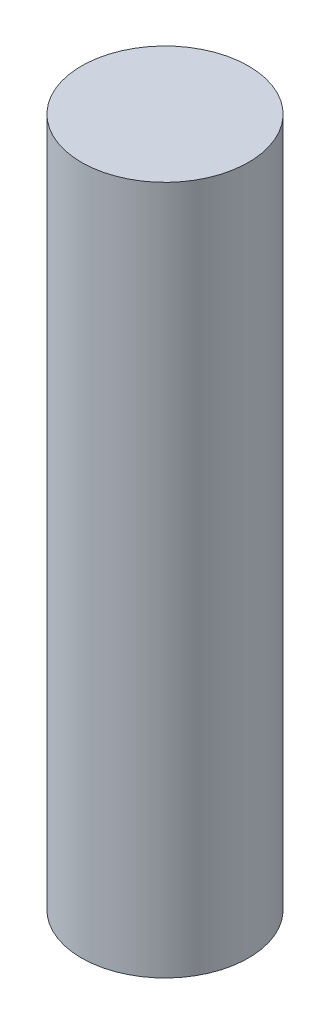
ISO-10303-21;
HEADER;
FILE_DESCRIPTION(('STEP AP214'),'2;1');
FILE_NAME('part.step','',(''),(''),'','','');
FILE_SCHEMA(('AUTOMOTIVE_DESIGN { 1 0 10303 214 1 1 1 1 }'));
ENDSEC;
DATA;
#1=APPLICATION_CONTEXT('core data for automotive mechanical design processes');
#2=APPLICATION_PROTOCOL_DEFINITION('international standard','automotive_design',2000,#1);
#3=PRODUCT_CONTEXT('',#1,'mechanical');
#4=PRODUCT('Part','Part','',(#3));
#5=PRODUCT_RELATED_PRODUCT_CATEGORY('part','',(#4));
#6=PRODUCT_DEFINITION_FORMATION('','',#4);
#7=PRODUCT_DEFINITION_CONTEXT('part definition',#1,'design');
#8=PRODUCT_DEFINITION('design','',#6,#7);
#9=PRODUCT_DEFINITION_SHAPE('','',#8);
#10=(LENGTH_UNIT() NAMED_UNIT(*) SI_UNIT(.MILLI.,.METRE.));
#11=(NAMED_UNIT(*) PLANE_ANGLE_UNIT() SI_UNIT($,.RADIAN.));
#12=(NAMED_UNIT(*) SI_UNIT($,.STERADIAN.) SOLID_ANGLE_UNIT());
#13=UNCERTAINTY_MEASURE_WITH_UNIT(LENGTH_MEASURE(1.E-05),#10,'distance_accuracy_value','');
#14=(GEOMETRIC_REPRESENTATION_CONTEXT(3) GLOBAL_UNCERTAINTY_ASSIGNED_CONTEXT((#13)) GLOBAL_UNIT_ASSIGNED_CONTEXT((#10,
#11,#12)) REPRESENTATION_CONTEXT('',''));
#15=CARTESIAN_POINT('',(0.,0.,0.));
#16=DIRECTION('',(0.,0.,1.));
#17=DIRECTION('',(1.,0.,0.));
#18=AXIS2_PLACEMENT_3D('',#15,#16,#17);
#19=CARTESIAN_POINT('',(-35.4004596489972,19.8,-11.846880066912));
#20=DIRECTION('',(0.,-1.,0.));
#21=DIRECTION('',(0.,0.,-1.));
#22=AXIS2_PLACEMENT_3D('',#19,#20,#21);
#23=CYLINDRICAL_SURFACE('',#22,2.4);
#24=CARTESIAN_POINT('',(-35.4004596489972,19.8,-11.846880066912));
#25=DIRECTION('',(0.,1.,0.));
#26=DIRECTION('',(0.,0.,1.));
#27=AXIS2_PLACEMENT_3D('',#24,#25,#26);
#28=CIRCLE('',#27,2.4);
#29=CARTESIAN_POINT('',(-35.4004596489972,19.8,-9.44688006691204));
#30=VERTEX_POINT('',#29);
#31=EDGE_CURVE('E10',#30,#30,#28,.T.);
#32=ORIENTED_EDGE('',*,*,#31,.F.);
#33=EDGE_LOOP('',(#32));
#34=FACE_BOUND('',#33,.T.);
#35=CARTESIAN_POINT('',(-35.4004596489972,0.,-11.846880066912));
#36=DIRECTION('',(0.,1.,0.));
#37=DIRECTION('',(0.,0.,1.));
#38=AXIS2_PLACEMENT_3D('',#35,#36,#37);
#39=CIRCLE('',#38,2.4);
#40=CARTESIAN_POINT('',(-35.4004596489972,0.,-9.44688006691204));
#41=VERTEX_POINT('',#40);
#42=EDGE_CURVE('E34',#41,#41,#39,.T.);
#43=ORIENTED_EDGE('',*,*,#42,.T.);
#44=EDGE_LOOP('',(#43));
#45=FACE_BOUND('',#44,.T.);
#46=ADVANCED_FACE('F31',(#34,#45),#23,.T.);
#47=CARTESIAN_POINT('',(-35.4004596489972,19.8,-11.846880066912));
#48=DIRECTION('',(0.,1.,0.));
#49=DIRECTION('',(0.,0.,1.));
#50=AXIS2_PLACEMENT_3D('',#47,#48,#49);
#51=PLANE('',#50);
#52=ORIENTED_EDGE('',*,*,#31,.T.);
#53=EDGE_LOOP('',(#52));
#54=FACE_BOUND('',#53,.T.);
#55=ADVANCED_FACE('F46',(#54),#51,.T.);
#56=CARTESIAN_POINT('',(-35.4004596489972,0.,-11.846880066912));
#57=DIRECTION('',(0.,1.,0.));
#58=DIRECTION('',(0.,0.,1.));
#59=AXIS2_PLACEMENT_3D('',#56,#57,#58);
#60=PLANE('',#59);
#61=ORIENTED_EDGE('',*,*,#42,.F.);
#62=EDGE_LOOP('',(#61));
#63=FACE_BOUND('',#62,.T.);
#64=ADVANCED_FACE('F44',(#63),#60,.F.);
#65=CLOSED_SHELL('',(#46,#55,#64));
#66=MANIFOLD_SOLID_BREP('B2',#65);
#67=ADVANCED_BREP_SHAPE_REPRESENTATION('',(#18,#66),#14);
#68=SHAPE_DEFINITION_REPRESENTATION(#9,#67);
ENDSEC;
END-ISO-10303-21;
